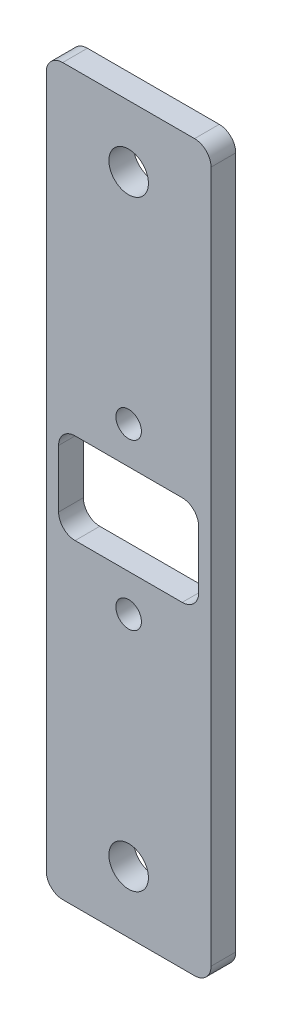
ISO-10303-21;
HEADER;
FILE_DESCRIPTION(('STEP AP214'),'2;1');
FILE_NAME('part.step','',(''),(''),'','','');
FILE_SCHEMA(('AUTOMOTIVE_DESIGN { 1 0 10303 214 1 1 1 1 }'));
ENDSEC;
DATA;
#1=APPLICATION_CONTEXT('core data for automotive mechanical design processes');
#2=APPLICATION_PROTOCOL_DEFINITION('international standard','automotive_design',2000,#1);
#3=PRODUCT_CONTEXT('',#1,'mechanical');
#4=PRODUCT('Part','Part','',(#3));
#5=PRODUCT_RELATED_PRODUCT_CATEGORY('part','',(#4));
#6=PRODUCT_DEFINITION_FORMATION('','',#4);
#7=PRODUCT_DEFINITION_CONTEXT('part definition',#1,'design');
#8=PRODUCT_DEFINITION('design','',#6,#7);
#9=PRODUCT_DEFINITION_SHAPE('','',#8);
#10=(LENGTH_UNIT() NAMED_UNIT(*) SI_UNIT(.MILLI.,.METRE.));
#11=(NAMED_UNIT(*) PLANE_ANGLE_UNIT() SI_UNIT($,.RADIAN.));
#12=(NAMED_UNIT(*) SI_UNIT($,.STERADIAN.) SOLID_ANGLE_UNIT());
#13=UNCERTAINTY_MEASURE_WITH_UNIT(LENGTH_MEASURE(1.E-05),#10,'distance_accuracy_value','');
#14=(GEOMETRIC_REPRESENTATION_CONTEXT(3) GLOBAL_UNCERTAINTY_ASSIGNED_CONTEXT((#13)) GLOBAL_UNIT_ASSIGNED_CONTEXT((#10,
#11,#12)) REPRESENTATION_CONTEXT('',''));
#15=CARTESIAN_POINT('',(0.,0.,0.));
#16=DIRECTION('',(0.,0.,1.));
#17=DIRECTION('',(1.,0.,0.));
#18=AXIS2_PLACEMENT_3D('',#15,#16,#17);
#19=CARTESIAN_POINT('',(0.,0.,3.));
#20=DIRECTION('',(0.,0.,-1.));
#21=DIRECTION('',(-1.,0.,0.));
#22=AXIS2_PLACEMENT_3D('',#19,#20,#21);
#23=PLANE('',#22);
#24=DIRECTION('',(0.,1.,0.));
#25=VECTOR('',#24,1.);
#26=CARTESIAN_POINT('',(0.,0.,3.));
#27=LINE('',#26,#25);
#28=CARTESIAN_POINT('',(0.,2.,3.));
#29=VERTEX_POINT('',#28);
#30=CARTESIAN_POINT('',(0.,86.,3.));
#31=VERTEX_POINT('',#30);
#32=EDGE_CURVE('E276',#29,#31,#27,.T.);
#33=ORIENTED_EDGE('',*,*,#32,.T.);
#34=CARTESIAN_POINT('',(-2.00000000000002,86.,3.));
#35=DIRECTION('',(0.,0.,-1.));
#36=DIRECTION('',(-1.,0.,0.));
#37=AXIS2_PLACEMENT_3D('',#34,#35,#36);
#38=CIRCLE('',#37,2.);
#39=CARTESIAN_POINT('',(-2.00000000000002,88.,3.));
#40=VERTEX_POINT('',#39);
#41=EDGE_CURVE('E222',#31,#40,#38,.F.);
#42=ORIENTED_EDGE('',*,*,#41,.T.);
#43=DIRECTION('',(-1.,0.,0.));
#44=VECTOR('',#43,1.);
#45=CARTESIAN_POINT('',(0.,88.,3.));
#46=LINE('',#45,#44);
#47=CARTESIAN_POINT('',(-18.,88.,3.));
#48=VERTEX_POINT('',#47);
#49=EDGE_CURVE('E180',#40,#48,#46,.T.);
#50=ORIENTED_EDGE('',*,*,#49,.T.);
#51=CARTESIAN_POINT('',(-18.,86.,3.));
#52=DIRECTION('',(0.,0.,-1.));
#53=DIRECTION('',(-1.,0.,0.));
#54=AXIS2_PLACEMENT_3D('',#51,#52,#53);
#55=CIRCLE('',#54,2.);
#56=CARTESIAN_POINT('',(-20.,86.,3.));
#57=VERTEX_POINT('',#56);
#58=EDGE_CURVE('E61',#48,#57,#55,.F.);
#59=ORIENTED_EDGE('',*,*,#58,.T.);
#60=DIRECTION('',(0.,-1.,0.));
#61=VECTOR('',#60,1.);
#62=CARTESIAN_POINT('',(-20.,0.,3.));
#63=LINE('',#62,#61);
#64=CARTESIAN_POINT('',(-20.,2.,3.));
#65=VERTEX_POINT('',#64);
#66=EDGE_CURVE('E176',#57,#65,#63,.T.);
#67=ORIENTED_EDGE('',*,*,#66,.T.);
#68=CARTESIAN_POINT('',(-18.,2.,3.));
#69=DIRECTION('',(0.,0.,-1.));
#70=DIRECTION('',(-1.,0.,0.));
#71=AXIS2_PLACEMENT_3D('',#68,#69,#70);
#72=CIRCLE('',#71,2.);
#73=CARTESIAN_POINT('',(-18.,0.,3.));
#74=VERTEX_POINT('',#73);
#75=EDGE_CURVE('E219',#65,#74,#72,.F.);
#76=ORIENTED_EDGE('',*,*,#75,.T.);
#77=DIRECTION('',(1.,0.,0.));
#78=VECTOR('',#77,1.);
#79=CARTESIAN_POINT('',(0.,0.,3.));
#80=LINE('',#79,#78);
#81=CARTESIAN_POINT('',(-2.,0.,3.));
#82=VERTEX_POINT('',#81);
#83=EDGE_CURVE('E273',#74,#82,#80,.T.);
#84=ORIENTED_EDGE('',*,*,#83,.T.);
#85=CARTESIAN_POINT('',(-2.,2.,3.));
#86=DIRECTION('',(0.,0.,-1.));
#87=DIRECTION('',(-1.,0.,0.));
#88=AXIS2_PLACEMENT_3D('',#85,#86,#87);
#89=CIRCLE('',#88,2.);
#90=EDGE_CURVE('E217',#82,#29,#89,.F.);
#91=ORIENTED_EDGE('',*,*,#90,.T.);
#92=EDGE_LOOP('',(#33,#42,#50,#59,#67,#76,#84,#91));
#93=FACE_BOUND('',#92,.T.);
#94=DIRECTION('',(-1.,0.,0.));
#95=VECTOR('',#94,1.);
#96=CARTESIAN_POINT('',(-1.50000000000002,49.5,3.));
#97=LINE('',#96,#95);
#98=CARTESIAN_POINT('',(-3.50000000000002,49.5,3.));
#99=VERTEX_POINT('',#98);
#100=CARTESIAN_POINT('',(-16.5,49.5,3.));
#101=VERTEX_POINT('',#100);
#102=EDGE_CURVE('E249',#99,#101,#97,.T.);
#103=ORIENTED_EDGE('',*,*,#102,.F.);
#104=CARTESIAN_POINT('',(-3.50000000000002,47.5,3.));
#105=DIRECTION('',(0.,0.,-1.));
#106=DIRECTION('',(-1.,0.,0.));
#107=AXIS2_PLACEMENT_3D('',#104,#105,#106);
#108=CIRCLE('',#107,2.);
#109=CARTESIAN_POINT('',(-1.50000000000002,47.5,3.));
#110=VERTEX_POINT('',#109);
#111=EDGE_CURVE('E239',#99,#110,#108,.T.);
#112=ORIENTED_EDGE('',*,*,#111,.T.);
#113=DIRECTION('',(0.,1.,0.));
#114=VECTOR('',#113,1.);
#115=CARTESIAN_POINT('',(-1.50000000000002,38.5,3.));
#116=LINE('',#115,#114);
#117=CARTESIAN_POINT('',(-1.50000000000002,40.5,3.));
#118=VERTEX_POINT('',#117);
#119=EDGE_CURVE('E284',#118,#110,#116,.T.);
#120=ORIENTED_EDGE('',*,*,#119,.F.);
#121=CARTESIAN_POINT('',(-3.50000000000002,40.5,3.));
#122=DIRECTION('',(0.,0.,-1.));
#123=DIRECTION('',(-1.,0.,0.));
#124=AXIS2_PLACEMENT_3D('',#121,#122,#123);
#125=CIRCLE('',#124,2.);
#126=CARTESIAN_POINT('',(-3.50000000000002,38.5,3.));
#127=VERTEX_POINT('',#126);
#128=EDGE_CURVE('E235',#118,#127,#125,.T.);
#129=ORIENTED_EDGE('',*,*,#128,.T.);
#130=DIRECTION('',(1.,0.,0.));
#131=VECTOR('',#130,1.);
#132=CARTESIAN_POINT('',(-1.50000000000002,38.5,3.));
#133=LINE('',#132,#131);
#134=CARTESIAN_POINT('',(-16.5,38.5,3.));
#135=VERTEX_POINT('',#134);
#136=EDGE_CURVE('E517',#135,#127,#133,.T.);
#137=ORIENTED_EDGE('',*,*,#136,.F.);
#138=CARTESIAN_POINT('',(-16.5,40.5,3.));
#139=DIRECTION('',(0.,0.,-1.));
#140=DIRECTION('',(-1.,0.,0.));
#141=AXIS2_PLACEMENT_3D('',#138,#139,#140);
#142=CIRCLE('',#141,2.);
#143=CARTESIAN_POINT('',(-18.5,40.5,3.));
#144=VERTEX_POINT('',#143);
#145=EDGE_CURVE('E11',#135,#144,#142,.T.);
#146=ORIENTED_EDGE('',*,*,#145,.T.);
#147=DIRECTION('',(0.,-1.,0.));
#148=VECTOR('',#147,1.);
#149=CARTESIAN_POINT('',(-18.5,38.5,3.));
#150=LINE('',#149,#148);
#151=CARTESIAN_POINT('',(-18.5,47.5,3.));
#152=VERTEX_POINT('',#151);
#153=EDGE_CURVE('E252',#152,#144,#150,.T.);
#154=ORIENTED_EDGE('',*,*,#153,.F.);
#155=CARTESIAN_POINT('',(-16.5,47.5,3.));
#156=DIRECTION('',(0.,0.,-1.));
#157=DIRECTION('',(-1.,0.,0.));
#158=AXIS2_PLACEMENT_3D('',#155,#156,#157);
#159=CIRCLE('',#158,2.);
#160=EDGE_CURVE('E163',#152,#101,#159,.T.);
#161=ORIENTED_EDGE('',*,*,#160,.T.);
#162=EDGE_LOOP('',(#103,#112,#120,#129,#137,#146,#154,#161));
#163=FACE_BOUND('',#162,.T.);
#164=CARTESIAN_POINT('',(-10.,7.5,3.));
#165=DIRECTION('',(0.,0.,1.));
#166=DIRECTION('',(1.,0.,0.));
#167=AXIS2_PLACEMENT_3D('',#164,#165,#166);
#168=CIRCLE('',#167,2.4);
#169=CARTESIAN_POINT('',(-7.6,7.5,3.));
#170=VERTEX_POINT('',#169);
#171=EDGE_CURVE('E267',#170,#170,#168,.T.);
#172=ORIENTED_EDGE('',*,*,#171,.F.);
#173=EDGE_LOOP('',(#172));
#174=FACE_BOUND('',#173,.T.);
#175=CARTESIAN_POINT('',(-10.,80.5,3.));
#176=DIRECTION('',(0.,0.,1.));
#177=DIRECTION('',(1.,0.,0.));
#178=AXIS2_PLACEMENT_3D('',#175,#176,#177);
#179=CIRCLE('',#178,2.4);
#180=CARTESIAN_POINT('',(-7.6,80.5,3.));
#181=VERTEX_POINT('',#180);
#182=EDGE_CURVE('E524',#181,#181,#179,.T.);
#183=ORIENTED_EDGE('',*,*,#182,.F.);
#184=EDGE_LOOP('',(#183));
#185=FACE_BOUND('',#184,.T.);
#186=CARTESIAN_POINT('',(-10.,54.,3.));
#187=DIRECTION('',(0.,0.,1.));
#188=DIRECTION('',(1.,0.,0.));
#189=AXIS2_PLACEMENT_3D('',#186,#187,#188);
#190=CIRCLE('',#189,1.55);
#191=CARTESIAN_POINT('',(-8.45,54.,3.));
#192=VERTEX_POINT('',#191);
#193=EDGE_CURVE('E530',#192,#192,#190,.T.);
#194=ORIENTED_EDGE('',*,*,#193,.F.);
#195=EDGE_LOOP('',(#194));
#196=FACE_BOUND('',#195,.T.);
#197=CARTESIAN_POINT('',(-10.,34.,3.));
#198=DIRECTION('',(0.,0.,1.));
#199=DIRECTION('',(1.,0.,0.));
#200=AXIS2_PLACEMENT_3D('',#197,#198,#199);
#201=CIRCLE('',#200,1.55);
#202=CARTESIAN_POINT('',(-8.45,34.,3.));
#203=VERTEX_POINT('',#202);
#204=EDGE_CURVE('E535',#203,#203,#201,.T.);
#205=ORIENTED_EDGE('',*,*,#204,.F.);
#206=EDGE_LOOP('',(#205));
#207=FACE_BOUND('',#206,.T.);
#208=ADVANCED_FACE('F39',(#93,#163,#174,#185,#196,#207),#23,.F.);
#209=CARTESIAN_POINT('',(0.,0.,0.));
#210=DIRECTION('',(0.,0.,-1.));
#211=DIRECTION('',(-1.,0.,0.));
#212=AXIS2_PLACEMENT_3D('',#209,#210,#211);
#213=PLANE('',#212);
#214=CARTESIAN_POINT('',(-10.,54.,0.));
#215=DIRECTION('',(0.,0.,1.));
#216=DIRECTION('',(1.,0.,0.));
#217=AXIS2_PLACEMENT_3D('',#214,#215,#216);
#218=CIRCLE('',#217,1.55);
#219=CARTESIAN_POINT('',(-8.45,54.,0.));
#220=VERTEX_POINT('',#219);
#221=EDGE_CURVE('E533',#220,#220,#218,.T.);
#222=ORIENTED_EDGE('',*,*,#221,.T.);
#223=EDGE_LOOP('',(#222));
#224=FACE_BOUND('',#223,.T.);
#225=CARTESIAN_POINT('',(-10.,7.5,0.));
#226=DIRECTION('',(0.,0.,1.));
#227=DIRECTION('',(1.,0.,0.));
#228=AXIS2_PLACEMENT_3D('',#225,#226,#227);
#229=CIRCLE('',#228,2.4);
#230=CARTESIAN_POINT('',(-7.6,7.5,0.));
#231=VERTEX_POINT('',#230);
#232=EDGE_CURVE('E521',#231,#231,#229,.T.);
#233=ORIENTED_EDGE('',*,*,#232,.T.);
#234=EDGE_LOOP('',(#233));
#235=FACE_BOUND('',#234,.T.);
#236=DIRECTION('',(-1.,0.,0.));
#237=VECTOR('',#236,1.);
#238=CARTESIAN_POINT('',(0.,88.,0.));
#239=LINE('',#238,#237);
#240=CARTESIAN_POINT('',(-2.00000000000002,88.,0.));
#241=VERTEX_POINT('',#240);
#242=CARTESIAN_POINT('',(-18.,88.,0.));
#243=VERTEX_POINT('',#242);
#244=EDGE_CURVE('E286',#241,#243,#239,.T.);
#245=ORIENTED_EDGE('',*,*,#244,.F.);
#246=CARTESIAN_POINT('',(-2.00000000000002,86.,0.));
#247=DIRECTION('',(0.,0.,-1.));
#248=DIRECTION('',(-1.,0.,0.));
#249=AXIS2_PLACEMENT_3D('',#246,#247,#248);
#250=CIRCLE('',#249,2.);
#251=CARTESIAN_POINT('',(0.,86.,0.));
#252=VERTEX_POINT('',#251);
#253=EDGE_CURVE('E210',#241,#252,#250,.T.);
#254=ORIENTED_EDGE('',*,*,#253,.T.);
#255=DIRECTION('',(0.,1.,0.));
#256=VECTOR('',#255,1.);
#257=CARTESIAN_POINT('',(0.,0.,0.));
#258=LINE('',#257,#256);
#259=CARTESIAN_POINT('',(0.,2.,0.));
#260=VERTEX_POINT('',#259);
#261=EDGE_CURVE('E283',#260,#252,#258,.T.);
#262=ORIENTED_EDGE('',*,*,#261,.F.);
#263=CARTESIAN_POINT('',(-2.,2.,0.));
#264=DIRECTION('',(0.,0.,-1.));
#265=DIRECTION('',(-1.,0.,0.));
#266=AXIS2_PLACEMENT_3D('',#263,#264,#265);
#267=CIRCLE('',#266,2.);
#268=CARTESIAN_POINT('',(-2.,0.,0.));
#269=VERTEX_POINT('',#268);
#270=EDGE_CURVE('E204',#260,#269,#267,.T.);
#271=ORIENTED_EDGE('',*,*,#270,.T.);
#272=DIRECTION('',(1.,0.,0.));
#273=VECTOR('',#272,1.);
#274=CARTESIAN_POINT('',(0.,0.,0.));
#275=LINE('',#274,#273);
#276=CARTESIAN_POINT('',(-18.,0.,0.));
#277=VERTEX_POINT('',#276);
#278=EDGE_CURVE('E280',#277,#269,#275,.T.);
#279=ORIENTED_EDGE('',*,*,#278,.F.);
#280=CARTESIAN_POINT('',(-18.,2.,0.));
#281=DIRECTION('',(0.,0.,-1.));
#282=DIRECTION('',(-1.,0.,0.));
#283=AXIS2_PLACEMENT_3D('',#280,#281,#282);
#284=CIRCLE('',#283,2.);
#285=CARTESIAN_POINT('',(-20.,2.,0.));
#286=VERTEX_POINT('',#285);
#287=EDGE_CURVE('E206',#277,#286,#284,.T.);
#288=ORIENTED_EDGE('',*,*,#287,.T.);
#289=DIRECTION('',(0.,-1.,0.));
#290=VECTOR('',#289,1.);
#291=CARTESIAN_POINT('',(-20.,0.,0.));
#292=LINE('',#291,#290);
#293=CARTESIAN_POINT('',(-20.,86.,0.));
#294=VERTEX_POINT('',#293);
#295=EDGE_CURVE('E183',#294,#286,#292,.T.);
#296=ORIENTED_EDGE('',*,*,#295,.F.);
#297=CARTESIAN_POINT('',(-18.,86.,0.));
#298=DIRECTION('',(0.,0.,-1.));
#299=DIRECTION('',(-1.,0.,0.));
#300=AXIS2_PLACEMENT_3D('',#297,#298,#299);
#301=CIRCLE('',#300,2.);
#302=EDGE_CURVE('E208',#294,#243,#301,.T.);
#303=ORIENTED_EDGE('',*,*,#302,.T.);
#304=EDGE_LOOP('',(#245,#254,#262,#271,#279,#288,#296,#303));
#305=FACE_BOUND('',#304,.T.);
#306=DIRECTION('',(1.,0.,0.));
#307=VECTOR('',#306,1.);
#308=CARTESIAN_POINT('',(-1.50000000000002,38.5,0.));
#309=LINE('',#308,#307);
#310=CARTESIAN_POINT('',(-16.5,38.5,0.));
#311=VERTEX_POINT('',#310);
#312=CARTESIAN_POINT('',(-3.50000000000002,38.5,0.));
#313=VERTEX_POINT('',#312);
#314=EDGE_CURVE('E156',#311,#313,#309,.T.);
#315=ORIENTED_EDGE('',*,*,#314,.T.);
#316=CARTESIAN_POINT('',(-3.50000000000002,40.5,0.));
#317=DIRECTION('',(0.,0.,-1.));
#318=DIRECTION('',(-1.,0.,0.));
#319=AXIS2_PLACEMENT_3D('',#316,#317,#318);
#320=CIRCLE('',#319,2.);
#321=CARTESIAN_POINT('',(-1.50000000000002,40.5,0.));
#322=VERTEX_POINT('',#321);
#323=EDGE_CURVE('E233',#313,#322,#320,.F.);
#324=ORIENTED_EDGE('',*,*,#323,.T.);
#325=DIRECTION('',(0.,1.,0.));
#326=VECTOR('',#325,1.);
#327=CARTESIAN_POINT('',(-1.50000000000002,38.5,0.));
#328=LINE('',#327,#326);
#329=CARTESIAN_POINT('',(-1.50000000000002,47.5,0.));
#330=VERTEX_POINT('',#329);
#331=EDGE_CURVE('E172',#322,#330,#328,.T.);
#332=ORIENTED_EDGE('',*,*,#331,.T.);
#333=CARTESIAN_POINT('',(-3.50000000000002,47.5,0.));
#334=DIRECTION('',(0.,0.,-1.));
#335=DIRECTION('',(-1.,0.,0.));
#336=AXIS2_PLACEMENT_3D('',#333,#334,#335);
#337=CIRCLE('',#336,2.);
#338=CARTESIAN_POINT('',(-3.50000000000002,49.5,0.));
#339=VERTEX_POINT('',#338);
#340=EDGE_CURVE('E237',#330,#339,#337,.F.);
#341=ORIENTED_EDGE('',*,*,#340,.T.);
#342=DIRECTION('',(-1.,0.,0.));
#343=VECTOR('',#342,1.);
#344=CARTESIAN_POINT('',(-1.50000000000002,49.5,0.));
#345=LINE('',#344,#343);
#346=CARTESIAN_POINT('',(-16.5,49.5,0.));
#347=VERTEX_POINT('',#346);
#348=EDGE_CURVE('E263',#339,#347,#345,.T.);
#349=ORIENTED_EDGE('',*,*,#348,.T.);
#350=CARTESIAN_POINT('',(-16.5,47.5,0.));
#351=DIRECTION('',(0.,0.,-1.));
#352=DIRECTION('',(-1.,0.,0.));
#353=AXIS2_PLACEMENT_3D('',#350,#351,#352);
#354=CIRCLE('',#353,2.);
#355=CARTESIAN_POINT('',(-18.5,47.5,0.));
#356=VERTEX_POINT('',#355);
#357=EDGE_CURVE('E241',#347,#356,#354,.F.);
#358=ORIENTED_EDGE('',*,*,#357,.T.);
#359=DIRECTION('',(0.,-1.,0.));
#360=VECTOR('',#359,1.);
#361=CARTESIAN_POINT('',(-18.5,38.5,0.));
#362=LINE('',#361,#360);
#363=CARTESIAN_POINT('',(-18.5,40.5,0.));
#364=VERTEX_POINT('',#363);
#365=EDGE_CURVE('E158',#356,#364,#362,.T.);
#366=ORIENTED_EDGE('',*,*,#365,.T.);
#367=CARTESIAN_POINT('',(-16.5,40.5,0.));
#368=DIRECTION('',(0.,0.,-1.));
#369=DIRECTION('',(-1.,0.,0.));
#370=AXIS2_PLACEMENT_3D('',#367,#368,#369);
#371=CIRCLE('',#370,2.);
#372=EDGE_CURVE('E47',#364,#311,#371,.F.);
#373=ORIENTED_EDGE('',*,*,#372,.T.);
#374=EDGE_LOOP('',(#315,#324,#332,#341,#349,#358,#366,#373));
#375=FACE_BOUND('',#374,.T.);
#376=CARTESIAN_POINT('',(-10.,80.5,0.));
#377=DIRECTION('',(0.,0.,1.));
#378=DIRECTION('',(1.,0.,0.));
#379=AXIS2_PLACEMENT_3D('',#376,#377,#378);
#380=CIRCLE('',#379,2.4);
#381=CARTESIAN_POINT('',(-7.6,80.5,0.));
#382=VERTEX_POINT('',#381);
#383=EDGE_CURVE('E527',#382,#382,#380,.T.);
#384=ORIENTED_EDGE('',*,*,#383,.T.);
#385=EDGE_LOOP('',(#384));
#386=FACE_BOUND('',#385,.T.);
#387=CARTESIAN_POINT('',(-10.,34.,0.));
#388=DIRECTION('',(0.,0.,1.));
#389=DIRECTION('',(1.,0.,0.));
#390=AXIS2_PLACEMENT_3D('',#387,#388,#389);
#391=CIRCLE('',#390,1.55);
#392=CARTESIAN_POINT('',(-8.45,34.,0.));
#393=VERTEX_POINT('',#392);
#394=EDGE_CURVE('E538',#393,#393,#391,.T.);
#395=ORIENTED_EDGE('',*,*,#394,.T.);
#396=EDGE_LOOP('',(#395));
#397=FACE_BOUND('',#396,.T.);
#398=ADVANCED_FACE('F154',(#224,#235,#305,#375,#386,#397),#213,.T.);
#399=CARTESIAN_POINT('',(0.,0.,3.));
#400=DIRECTION('',(0.,1.,0.));
#401=DIRECTION('',(0.,0.,1.));
#402=AXIS2_PLACEMENT_3D('',#399,#400,#401);
#403=PLANE('',#402);
#404=ORIENTED_EDGE('',*,*,#83,.F.);
#405=DIRECTION('',(0.,0.,-1.));
#406=VECTOR('',#405,1.);
#407=CARTESIAN_POINT('',(-18.,0.,3.));
#408=LINE('',#407,#406);
#409=EDGE_CURVE('E230',#74,#277,#408,.T.);
#410=ORIENTED_EDGE('',*,*,#409,.T.);
#411=ORIENTED_EDGE('',*,*,#278,.T.);
#412=DIRECTION('',(0.,0.,-1.));
#413=VECTOR('',#412,1.);
#414=CARTESIAN_POINT('',(-2.,0.,3.));
#415=LINE('',#414,#413);
#416=EDGE_CURVE('E228',#269,#82,#415,.F.);
#417=ORIENTED_EDGE('',*,*,#416,.T.);
#418=EDGE_LOOP('',(#404,#410,#411,#417));
#419=FACE_BOUND('',#418,.T.);
#420=ADVANCED_FACE('F302',(#419),#403,.F.);
#421=CARTESIAN_POINT('',(0.,0.,3.));
#422=DIRECTION('',(-1.,0.,0.));
#423=DIRECTION('',(0.,-1.,0.));
#424=AXIS2_PLACEMENT_3D('',#421,#422,#423);
#425=PLANE('',#424);
#426=ORIENTED_EDGE('',*,*,#261,.T.);
#427=DIRECTION('',(0.,0.,-1.));
#428=VECTOR('',#427,1.);
#429=CARTESIAN_POINT('',(0.,86.,3.));
#430=LINE('',#429,#428);
#431=EDGE_CURVE('E215',#252,#31,#430,.F.);
#432=ORIENTED_EDGE('',*,*,#431,.T.);
#433=ORIENTED_EDGE('',*,*,#32,.F.);
#434=DIRECTION('',(0.,0.,-1.));
#435=VECTOR('',#434,1.);
#436=CARTESIAN_POINT('',(0.,2.,3.));
#437=LINE('',#436,#435);
#438=EDGE_CURVE('E212',#29,#260,#437,.T.);
#439=ORIENTED_EDGE('',*,*,#438,.T.);
#440=EDGE_LOOP('',(#426,#432,#433,#439));
#441=FACE_BOUND('',#440,.T.);
#442=ADVANCED_FACE('F310',(#441),#425,.F.);
#443=CARTESIAN_POINT('',(0.,88.,3.));
#444=DIRECTION('',(0.,-1.,0.));
#445=DIRECTION('',(0.,0.,-1.));
#446=AXIS2_PLACEMENT_3D('',#443,#444,#445);
#447=PLANE('',#446);
#448=ORIENTED_EDGE('',*,*,#49,.F.);
#449=DIRECTION('',(0.,0.,-1.));
#450=VECTOR('',#449,1.);
#451=CARTESIAN_POINT('',(-2.00000000000002,88.,3.));
#452=LINE('',#451,#450);
#453=EDGE_CURVE('E201',#40,#241,#452,.T.);
#454=ORIENTED_EDGE('',*,*,#453,.T.);
#455=ORIENTED_EDGE('',*,*,#244,.T.);
#456=DIRECTION('',(0.,0.,-1.));
#457=VECTOR('',#456,1.);
#458=CARTESIAN_POINT('',(-18.,88.,3.));
#459=LINE('',#458,#457);
#460=EDGE_CURVE('E199',#243,#48,#459,.F.);
#461=ORIENTED_EDGE('',*,*,#460,.T.);
#462=EDGE_LOOP('',(#448,#454,#455,#461));
#463=FACE_BOUND('',#462,.T.);
#464=ADVANCED_FACE('F317',(#463),#447,.F.);
#465=CARTESIAN_POINT('',(-20.,0.,3.));
#466=DIRECTION('',(1.,0.,0.));
#467=DIRECTION('',(0.,0.,-1.));
#468=AXIS2_PLACEMENT_3D('',#465,#466,#467);
#469=PLANE('',#468);
#470=ORIENTED_EDGE('',*,*,#66,.F.);
#471=DIRECTION('',(0.,0.,-1.));
#472=VECTOR('',#471,1.);
#473=CARTESIAN_POINT('',(-20.,86.,3.));
#474=LINE('',#473,#472);
#475=EDGE_CURVE('E225',#57,#294,#474,.T.);
#476=ORIENTED_EDGE('',*,*,#475,.T.);
#477=ORIENTED_EDGE('',*,*,#295,.T.);
#478=DIRECTION('',(0.,0.,-1.));
#479=VECTOR('',#478,1.);
#480=CARTESIAN_POINT('',(-20.,2.,3.));
#481=LINE('',#480,#479);
#482=EDGE_CURVE('E54',#286,#65,#481,.F.);
#483=ORIENTED_EDGE('',*,*,#482,.T.);
#484=EDGE_LOOP('',(#470,#476,#477,#483));
#485=FACE_BOUND('',#484,.T.);
#486=ADVANCED_FACE('F292',(#485),#469,.F.);
#487=CARTESIAN_POINT('',(-1.50000000000002,49.5,3.));
#488=DIRECTION('',(0.,-1.,0.));
#489=DIRECTION('',(0.,0.,-1.));
#490=AXIS2_PLACEMENT_3D('',#487,#488,#489);
#491=PLANE('',#490);
#492=ORIENTED_EDGE('',*,*,#348,.F.);
#493=DIRECTION('',(0.,0.,-1.));
#494=VECTOR('',#493,1.);
#495=CARTESIAN_POINT('',(-3.50000000000002,49.5,3.));
#496=LINE('',#495,#494);
#497=EDGE_CURVE('E193',#339,#99,#496,.F.);
#498=ORIENTED_EDGE('',*,*,#497,.T.);
#499=ORIENTED_EDGE('',*,*,#102,.T.);
#500=DIRECTION('',(0.,0.,-1.));
#501=VECTOR('',#500,1.);
#502=CARTESIAN_POINT('',(-16.5,49.5,0.));
#503=LINE('',#502,#501);
#504=EDGE_CURVE('E190',#101,#347,#503,.T.);
#505=ORIENTED_EDGE('',*,*,#504,.T.);
#506=EDGE_LOOP('',(#492,#498,#499,#505));
#507=FACE_BOUND('',#506,.T.);
#508=ADVANCED_FACE('F258',(#507),#491,.T.);
#509=CARTESIAN_POINT('',(-18.5,38.5,3.));
#510=DIRECTION('',(1.,0.,0.));
#511=DIRECTION('',(0.,0.,-1.));
#512=AXIS2_PLACEMENT_3D('',#509,#510,#511);
#513=PLANE('',#512);
#514=ORIENTED_EDGE('',*,*,#365,.F.);
#515=DIRECTION('',(0.,0.,-1.));
#516=VECTOR('',#515,1.);
#517=CARTESIAN_POINT('',(-18.5,47.5,3.));
#518=LINE('',#517,#516);
#519=EDGE_CURVE('E197',#356,#152,#518,.F.);
#520=ORIENTED_EDGE('',*,*,#519,.T.);
#521=ORIENTED_EDGE('',*,*,#153,.T.);
#522=DIRECTION('',(0.,0.,-1.));
#523=VECTOR('',#522,1.);
#524=CARTESIAN_POINT('',(-18.5,40.5,0.));
#525=LINE('',#524,#523);
#526=EDGE_CURVE('E195',#144,#364,#525,.T.);
#527=ORIENTED_EDGE('',*,*,#526,.T.);
#528=EDGE_LOOP('',(#514,#520,#521,#527));
#529=FACE_BOUND('',#528,.T.);
#530=ADVANCED_FACE('F265',(#529),#513,.T.);
#531=CARTESIAN_POINT('',(-1.50000000000002,38.5,3.));
#532=DIRECTION('',(0.,1.,0.));
#533=DIRECTION('',(0.,0.,1.));
#534=AXIS2_PLACEMENT_3D('',#531,#532,#533);
#535=PLANE('',#534);
#536=ORIENTED_EDGE('',*,*,#136,.T.);
#537=DIRECTION('',(0.,0.,-1.));
#538=VECTOR('',#537,1.);
#539=CARTESIAN_POINT('',(-3.50000000000002,38.5,0.));
#540=LINE('',#539,#538);
#541=EDGE_CURVE('E171',#127,#313,#540,.T.);
#542=ORIENTED_EDGE('',*,*,#541,.T.);
#543=ORIENTED_EDGE('',*,*,#314,.F.);
#544=DIRECTION('',(0.,0.,-1.));
#545=VECTOR('',#544,1.);
#546=CARTESIAN_POINT('',(-16.5,38.5,3.));
#547=LINE('',#546,#545);
#548=EDGE_CURVE('E168',#311,#135,#547,.F.);
#549=ORIENTED_EDGE('',*,*,#548,.T.);
#550=EDGE_LOOP('',(#536,#542,#543,#549));
#551=FACE_BOUND('',#550,.T.);
#552=ADVANCED_FACE('F167',(#551),#535,.T.);
#553=CARTESIAN_POINT('',(-1.50000000000002,38.5,3.));
#554=DIRECTION('',(-1.,0.,0.));
#555=DIRECTION('',(0.,0.,1.));
#556=AXIS2_PLACEMENT_3D('',#553,#554,#555);
#557=PLANE('',#556);
#558=ORIENTED_EDGE('',*,*,#331,.F.);
#559=DIRECTION('',(0.,0.,-1.));
#560=VECTOR('',#559,1.);
#561=CARTESIAN_POINT('',(-1.50000000000002,40.5,3.));
#562=LINE('',#561,#560);
#563=EDGE_CURVE('E188',#322,#118,#562,.F.);
#564=ORIENTED_EDGE('',*,*,#563,.T.);
#565=ORIENTED_EDGE('',*,*,#119,.T.);
#566=DIRECTION('',(0.,0.,-1.));
#567=VECTOR('',#566,1.);
#568=CARTESIAN_POINT('',(-1.50000000000002,47.5,0.));
#569=LINE('',#568,#567);
#570=EDGE_CURVE('E178',#110,#330,#569,.T.);
#571=ORIENTED_EDGE('',*,*,#570,.T.);
#572=EDGE_LOOP('',(#558,#564,#565,#571));
#573=FACE_BOUND('',#572,.T.);
#574=ADVANCED_FACE('F442',(#573),#557,.T.);
#575=CARTESIAN_POINT('',(-10.,7.5,3.));
#576=DIRECTION('',(0.,0.,-1.));
#577=DIRECTION('',(-1.,0.,0.));
#578=AXIS2_PLACEMENT_3D('',#575,#576,#577);
#579=CYLINDRICAL_SURFACE('',#578,2.4);
#580=ORIENTED_EDGE('',*,*,#171,.T.);
#581=EDGE_LOOP('',(#580));
#582=FACE_BOUND('',#581,.T.);
#583=ORIENTED_EDGE('',*,*,#232,.F.);
#584=EDGE_LOOP('',(#583));
#585=FACE_BOUND('',#584,.T.);
#586=ADVANCED_FACE('F432',(#582,#585),#579,.F.);
#587=CARTESIAN_POINT('',(-10.,80.5,3.));
#588=DIRECTION('',(0.,0.,-1.));
#589=DIRECTION('',(-1.,0.,0.));
#590=AXIS2_PLACEMENT_3D('',#587,#588,#589);
#591=CYLINDRICAL_SURFACE('',#590,2.4);
#592=ORIENTED_EDGE('',*,*,#182,.T.);
#593=EDGE_LOOP('',(#592));
#594=FACE_BOUND('',#593,.T.);
#595=ORIENTED_EDGE('',*,*,#383,.F.);
#596=EDGE_LOOP('',(#595));
#597=FACE_BOUND('',#596,.T.);
#598=ADVANCED_FACE('F422',(#594,#597),#591,.F.);
#599=CARTESIAN_POINT('',(-10.,54.,3.));
#600=DIRECTION('',(0.,0.,-1.));
#601=DIRECTION('',(-1.,0.,0.));
#602=AXIS2_PLACEMENT_3D('',#599,#600,#601);
#603=CYLINDRICAL_SURFACE('',#602,1.55);
#604=ORIENTED_EDGE('',*,*,#193,.T.);
#605=EDGE_LOOP('',(#604));
#606=FACE_BOUND('',#605,.T.);
#607=ORIENTED_EDGE('',*,*,#221,.F.);
#608=EDGE_LOOP('',(#607));
#609=FACE_BOUND('',#608,.T.);
#610=ADVANCED_FACE('F412',(#606,#609),#603,.F.);
#611=CARTESIAN_POINT('',(-10.,34.,3.));
#612=DIRECTION('',(0.,0.,-1.));
#613=DIRECTION('',(-1.,0.,0.));
#614=AXIS2_PLACEMENT_3D('',#611,#612,#613);
#615=CYLINDRICAL_SURFACE('',#614,1.55);
#616=ORIENTED_EDGE('',*,*,#204,.T.);
#617=EDGE_LOOP('',(#616));
#618=FACE_BOUND('',#617,.T.);
#619=ORIENTED_EDGE('',*,*,#394,.F.);
#620=EDGE_LOOP('',(#619));
#621=FACE_BOUND('',#620,.T.);
#622=ADVANCED_FACE('F343',(#618,#621),#615,.F.);
#623=CARTESIAN_POINT('',(-3.50000000000002,40.5,3.));
#624=DIRECTION('',(0.,0.,1.));
#625=DIRECTION('',(1.,0.,0.));
#626=AXIS2_PLACEMENT_3D('',#623,#624,#625);
#627=CYLINDRICAL_SURFACE('',#626,2.);
#628=ORIENTED_EDGE('',*,*,#128,.F.);
#629=ORIENTED_EDGE('',*,*,#563,.F.);
#630=ORIENTED_EDGE('',*,*,#323,.F.);
#631=ORIENTED_EDGE('',*,*,#541,.F.);
#632=EDGE_LOOP('',(#628,#629,#630,#631));
#633=FACE_BOUND('',#632,.T.);
#634=ADVANCED_FACE('F339',(#633),#627,.F.);
#635=CARTESIAN_POINT('',(-3.50000000000002,47.5,3.));
#636=DIRECTION('',(0.,0.,1.));
#637=DIRECTION('',(1.,0.,0.));
#638=AXIS2_PLACEMENT_3D('',#635,#636,#637);
#639=CYLINDRICAL_SURFACE('',#638,2.);
#640=ORIENTED_EDGE('',*,*,#111,.F.);
#641=ORIENTED_EDGE('',*,*,#497,.F.);
#642=ORIENTED_EDGE('',*,*,#340,.F.);
#643=ORIENTED_EDGE('',*,*,#570,.F.);
#644=EDGE_LOOP('',(#640,#641,#642,#643));
#645=FACE_BOUND('',#644,.T.);
#646=ADVANCED_FACE('F342',(#645),#639,.F.);
#647=CARTESIAN_POINT('',(-16.5,47.5,3.));
#648=DIRECTION('',(0.,0.,1.));
#649=DIRECTION('',(1.,0.,0.));
#650=AXIS2_PLACEMENT_3D('',#647,#648,#649);
#651=CYLINDRICAL_SURFACE('',#650,2.);
#652=ORIENTED_EDGE('',*,*,#160,.F.);
#653=ORIENTED_EDGE('',*,*,#519,.F.);
#654=ORIENTED_EDGE('',*,*,#357,.F.);
#655=ORIENTED_EDGE('',*,*,#504,.F.);
#656=EDGE_LOOP('',(#652,#653,#654,#655));
#657=FACE_BOUND('',#656,.T.);
#658=ADVANCED_FACE('F262',(#657),#651,.F.);
#659=CARTESIAN_POINT('',(-16.5,40.5,3.));
#660=DIRECTION('',(0.,0.,1.));
#661=DIRECTION('',(1.,0.,0.));
#662=AXIS2_PLACEMENT_3D('',#659,#660,#661);
#663=CYLINDRICAL_SURFACE('',#662,2.);
#664=ORIENTED_EDGE('',*,*,#145,.F.);
#665=ORIENTED_EDGE('',*,*,#548,.F.);
#666=ORIENTED_EDGE('',*,*,#372,.F.);
#667=ORIENTED_EDGE('',*,*,#526,.F.);
#668=EDGE_LOOP('',(#664,#665,#666,#667));
#669=FACE_BOUND('',#668,.T.);
#670=ADVANCED_FACE('F175',(#669),#663,.F.);
#671=CARTESIAN_POINT('',(-2.00000000000002,86.,3.));
#672=DIRECTION('',(0.,0.,-1.));
#673=DIRECTION('',(-1.,0.,0.));
#674=AXIS2_PLACEMENT_3D('',#671,#672,#673);
#675=CYLINDRICAL_SURFACE('',#674,2.);
#676=ORIENTED_EDGE('',*,*,#41,.F.);
#677=ORIENTED_EDGE('',*,*,#431,.F.);
#678=ORIENTED_EDGE('',*,*,#253,.F.);
#679=ORIENTED_EDGE('',*,*,#453,.F.);
#680=EDGE_LOOP('',(#676,#677,#678,#679));
#681=FACE_BOUND('',#680,.T.);
#682=ADVANCED_FACE('F314',(#681),#675,.T.);
#683=CARTESIAN_POINT('',(-18.,86.,3.));
#684=DIRECTION('',(0.,0.,-1.));
#685=DIRECTION('',(-1.,0.,0.));
#686=AXIS2_PLACEMENT_3D('',#683,#684,#685);
#687=CYLINDRICAL_SURFACE('',#686,2.);
#688=ORIENTED_EDGE('',*,*,#58,.F.);
#689=ORIENTED_EDGE('',*,*,#460,.F.);
#690=ORIENTED_EDGE('',*,*,#302,.F.);
#691=ORIENTED_EDGE('',*,*,#475,.F.);
#692=EDGE_LOOP('',(#688,#689,#690,#691));
#693=FACE_BOUND('',#692,.T.);
#694=ADVANCED_FACE('F319',(#693),#687,.T.);
#695=CARTESIAN_POINT('',(-18.,2.,3.));
#696=DIRECTION('',(0.,0.,-1.));
#697=DIRECTION('',(-1.,0.,0.));
#698=AXIS2_PLACEMENT_3D('',#695,#696,#697);
#699=CYLINDRICAL_SURFACE('',#698,2.);
#700=ORIENTED_EDGE('',*,*,#75,.F.);
#701=ORIENTED_EDGE('',*,*,#482,.F.);
#702=ORIENTED_EDGE('',*,*,#287,.F.);
#703=ORIENTED_EDGE('',*,*,#409,.F.);
#704=EDGE_LOOP('',(#700,#701,#702,#703));
#705=FACE_BOUND('',#704,.T.);
#706=ADVANCED_FACE('F297',(#705),#699,.T.);
#707=CARTESIAN_POINT('',(-2.,2.,3.));
#708=DIRECTION('',(0.,0.,-1.));
#709=DIRECTION('',(-1.,0.,0.));
#710=AXIS2_PLACEMENT_3D('',#707,#708,#709);
#711=CYLINDRICAL_SURFACE('',#710,2.);
#712=ORIENTED_EDGE('',*,*,#90,.F.);
#713=ORIENTED_EDGE('',*,*,#416,.F.);
#714=ORIENTED_EDGE('',*,*,#270,.F.);
#715=ORIENTED_EDGE('',*,*,#438,.F.);
#716=EDGE_LOOP('',(#712,#713,#714,#715));
#717=FACE_BOUND('',#716,.T.);
#718=ADVANCED_FACE('F41',(#717),#711,.T.);
#719=CLOSED_SHELL('',(#208,#398,#420,#442,#464,#486,#508,#530,#552,#574,#586,#598,#610,#622,
#634,#646,#658,#670,#682,#694,#706,#718));
#720=MANIFOLD_SOLID_BREP('B2',#719);
#721=ADVANCED_BREP_SHAPE_REPRESENTATION('',(#18,#720),#14);
#722=SHAPE_DEFINITION_REPRESENTATION(#9,#721);
ENDSEC;
END-ISO-10303-21;
